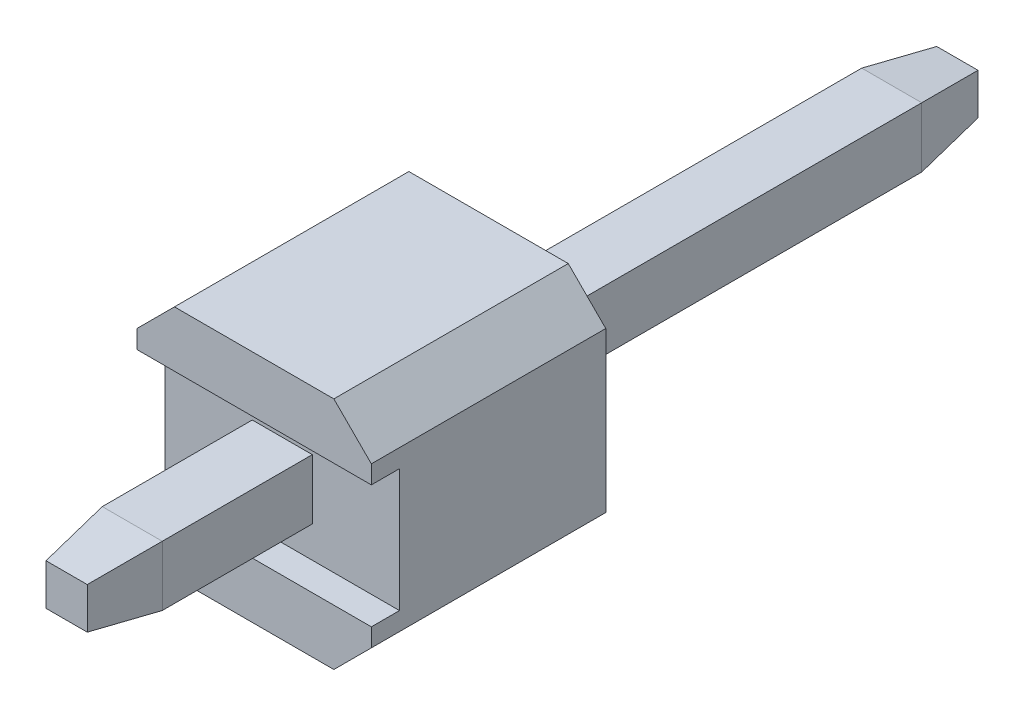
ISO-10303-21;
HEADER;
FILE_DESCRIPTION(('STEP AP214'),'2;1');
FILE_NAME('part.step','',(''),(''),'','','');
FILE_SCHEMA(('AUTOMOTIVE_DESIGN { 1 0 10303 214 1 1 1 1 }'));
ENDSEC;
DATA;
#1=APPLICATION_CONTEXT('core data for automotive mechanical design processes');
#2=APPLICATION_PROTOCOL_DEFINITION('international standard','automotive_design',2000,#1);
#3=PRODUCT_CONTEXT('',#1,'mechanical');
#4=PRODUCT('Part','Part','',(#3));
#5=PRODUCT_RELATED_PRODUCT_CATEGORY('part','',(#4));
#6=PRODUCT_DEFINITION_FORMATION('','',#4);
#7=PRODUCT_DEFINITION_CONTEXT('part definition',#1,'design');
#8=PRODUCT_DEFINITION('design','',#6,#7);
#9=PRODUCT_DEFINITION_SHAPE('','',#8);
#10=(LENGTH_UNIT() NAMED_UNIT(*) SI_UNIT(.MILLI.,.METRE.));
#11=(NAMED_UNIT(*) PLANE_ANGLE_UNIT() SI_UNIT($,.RADIAN.));
#12=(NAMED_UNIT(*) SI_UNIT($,.STERADIAN.) SOLID_ANGLE_UNIT());
#13=UNCERTAINTY_MEASURE_WITH_UNIT(LENGTH_MEASURE(1.E-05),#10,'distance_accuracy_value','');
#14=(GEOMETRIC_REPRESENTATION_CONTEXT(3) GLOBAL_UNCERTAINTY_ASSIGNED_CONTEXT((#13)) GLOBAL_UNIT_ASSIGNED_CONTEXT((#10,
#11,#12)) REPRESENTATION_CONTEXT('',''));
#15=CARTESIAN_POINT('',(0.,0.,0.));
#16=DIRECTION('',(0.,0.,1.));
#17=DIRECTION('',(1.,0.,0.));
#18=AXIS2_PLACEMENT_3D('',#15,#16,#17);
#19=CARTESIAN_POINT('',(-0.16,-0.27,-4.65));
#20=DIRECTION('',(0.,-0.989949493661167,-0.14142135623731));
#21=DIRECTION('',(0.,0.14142135623731,-0.989949493661167));
#22=AXIS2_PLACEMENT_3D('',#19,#20,#21);
#23=PLANE('',#22);
#24=DIRECTION('',(1.,0.,0.));
#25=VECTOR('',#24,1.);
#26=CARTESIAN_POINT('',(-0.16,-0.22,-5.));
#27=LINE('',#26,#25);
#28=CARTESIAN_POINT('',(-0.22,-0.22,-5.));
#29=VERTEX_POINT('',#28);
#30=CARTESIAN_POINT('',(0.22,-0.22,-5.));
#31=VERTEX_POINT('',#30);
#32=EDGE_CURVE('P0_E11',#29,#31,#27,.T.);
#33=ORIENTED_EDGE('',*,*,#32,.T.);
#34=DIRECTION('',(0.140028008402801,-0.140028008402801,0.980196058819607));
#35=VECTOR('',#34,1.);
#36=CARTESIAN_POINT('',(0.22,-0.22,-5.));
#37=LINE('',#36,#35);
#38=CARTESIAN_POINT('',(0.32,-0.32,-4.3));
#39=VERTEX_POINT('',#38);
#40=EDGE_CURVE('P0_E28',#31,#39,#37,.T.);
#41=ORIENTED_EDGE('',*,*,#40,.T.);
#42=DIRECTION('',(-1.,0.,0.));
#43=VECTOR('',#42,1.);
#44=CARTESIAN_POINT('',(-0.16,-0.32,-4.3));
#45=LINE('',#44,#43);
#46=CARTESIAN_POINT('',(-0.32,-0.32,-4.3));
#47=VERTEX_POINT('',#46);
#48=EDGE_CURVE('P0_E129',#39,#47,#45,.T.);
#49=ORIENTED_EDGE('',*,*,#48,.T.);
#50=DIRECTION('',(-0.140028008402801,-0.140028008402801,0.980196058819607));
#51=VECTOR('',#50,1.);
#52=CARTESIAN_POINT('',(-0.22,-0.22,-5.));
#53=LINE('',#52,#51);
#54=EDGE_CURVE('P0_E124',#29,#47,#53,.T.);
#55=ORIENTED_EDGE('',*,*,#54,.F.);
#56=EDGE_LOOP('',(#33,#41,#49,#55));
#57=FACE_BOUND('',#56,.T.);
#58=ADVANCED_FACE('P0_F17',(#57),#23,.T.);
#59=CARTESIAN_POINT('',(0.27,-0.16,-4.65));
#60=DIRECTION('',(0.989949493661167,0.,-0.14142135623731));
#61=DIRECTION('',(0.,-1.,0.));
#62=AXIS2_PLACEMENT_3D('',#59,#60,#61);
#63=PLANE('',#62);
#64=DIRECTION('',(0.,1.,0.));
#65=VECTOR('',#64,1.);
#66=CARTESIAN_POINT('',(0.22,-0.16,-5.));
#67=LINE('',#66,#65);
#68=CARTESIAN_POINT('',(0.22,0.22,-5.));
#69=VERTEX_POINT('',#68);
#70=EDGE_CURVE('P0_E132',#31,#69,#67,.T.);
#71=ORIENTED_EDGE('',*,*,#70,.T.);
#72=DIRECTION('',(0.140028008402801,0.140028008402801,0.980196058819607));
#73=VECTOR('',#72,1.);
#74=CARTESIAN_POINT('',(0.22,0.22,-5.));
#75=LINE('',#74,#73);
#76=CARTESIAN_POINT('',(0.32,0.32,-4.3));
#77=VERTEX_POINT('',#76);
#78=EDGE_CURVE('P0_E138',#69,#77,#75,.T.);
#79=ORIENTED_EDGE('',*,*,#78,.T.);
#80=DIRECTION('',(0.,-1.,0.));
#81=VECTOR('',#80,1.);
#82=CARTESIAN_POINT('',(0.32,-0.16,-4.3));
#83=LINE('',#82,#81);
#84=EDGE_CURVE('P0_E146',#77,#39,#83,.T.);
#85=ORIENTED_EDGE('',*,*,#84,.T.);
#86=ORIENTED_EDGE('',*,*,#40,.F.);
#87=EDGE_LOOP('',(#71,#79,#85,#86));
#88=FACE_BOUND('',#87,.T.);
#89=ADVANCED_FACE('P0_F182',(#88),#63,.T.);
#90=CARTESIAN_POINT('',(0.16,0.27,-4.65));
#91=DIRECTION('',(0.,0.989949493661167,-0.14142135623731));
#92=DIRECTION('',(-1.,0.,0.));
#93=AXIS2_PLACEMENT_3D('',#90,#91,#92);
#94=PLANE('',#93);
#95=DIRECTION('',(-1.,0.,0.));
#96=VECTOR('',#95,1.);
#97=CARTESIAN_POINT('',(0.16,0.22,-5.));
#98=LINE('',#97,#96);
#99=CARTESIAN_POINT('',(-0.22,0.22,-5.));
#100=VERTEX_POINT('',#99);
#101=EDGE_CURVE('P0_E150',#69,#100,#98,.T.);
#102=ORIENTED_EDGE('',*,*,#101,.T.);
#103=DIRECTION('',(-0.140028008402801,0.140028008402801,0.980196058819607));
#104=VECTOR('',#103,1.);
#105=CARTESIAN_POINT('',(-0.22,0.22,-5.));
#106=LINE('',#105,#104);
#107=CARTESIAN_POINT('',(-0.32,0.32,-4.3));
#108=VERTEX_POINT('',#107);
#109=EDGE_CURVE('P0_E153',#100,#108,#106,.T.);
#110=ORIENTED_EDGE('',*,*,#109,.T.);
#111=DIRECTION('',(1.,0.,0.));
#112=VECTOR('',#111,1.);
#113=CARTESIAN_POINT('',(0.16,0.32,-4.3));
#114=LINE('',#113,#112);
#115=EDGE_CURVE('P0_E103',#108,#77,#114,.T.);
#116=ORIENTED_EDGE('',*,*,#115,.T.);
#117=ORIENTED_EDGE('',*,*,#78,.F.);
#118=EDGE_LOOP('',(#102,#110,#116,#117));
#119=FACE_BOUND('',#118,.T.);
#120=ADVANCED_FACE('P0_F19',(#119),#94,.T.);
#121=CARTESIAN_POINT('',(-0.27,0.16,-4.65));
#122=DIRECTION('',(-0.989949493661167,0.,-0.14142135623731));
#123=DIRECTION('',(-0.14142135623731,0.,0.989949493661167));
#124=AXIS2_PLACEMENT_3D('',#121,#122,#123);
#125=PLANE('',#124);
#126=DIRECTION('',(0.,1.,0.));
#127=VECTOR('',#126,1.);
#128=CARTESIAN_POINT('',(-0.32,0.16,-4.3));
#129=LINE('',#128,#127);
#130=EDGE_CURVE('P0_E122',#47,#108,#129,.T.);
#131=ORIENTED_EDGE('',*,*,#130,.T.);
#132=ORIENTED_EDGE('',*,*,#109,.F.);
#133=DIRECTION('',(0.,-1.,0.));
#134=VECTOR('',#133,1.);
#135=CARTESIAN_POINT('',(-0.22,0.16,-5.));
#136=LINE('',#135,#134);
#137=EDGE_CURVE('P0_E127',#100,#29,#136,.T.);
#138=ORIENTED_EDGE('',*,*,#137,.T.);
#139=ORIENTED_EDGE('',*,*,#54,.T.);
#140=EDGE_LOOP('',(#131,#132,#138,#139));
#141=FACE_BOUND('',#140,.T.);
#142=ADVANCED_FACE('P0_F184',(#141),#125,.T.);
#143=CARTESIAN_POINT('',(-0.32,0.32,0.));
#144=DIRECTION('',(-1.,0.,0.));
#145=DIRECTION('',(0.,0.,1.));
#146=AXIS2_PLACEMENT_3D('',#143,#144,#145);
#147=PLANE('',#146);
#148=ORIENTED_EDGE('',*,*,#130,.F.);
#149=DIRECTION('',(0.,0.,1.));
#150=VECTOR('',#149,1.);
#151=CARTESIAN_POINT('',(-0.32,-0.32,0.));
#152=LINE('',#151,#150);
#153=CARTESIAN_POINT('',(-0.32,-0.32,2.));
#154=VERTEX_POINT('',#153);
#155=EDGE_CURVE('P0_E21',#47,#154,#152,.T.);
#156=ORIENTED_EDGE('',*,*,#155,.T.);
#157=DIRECTION('',(0.,-1.,0.));
#158=VECTOR('',#157,1.);
#159=CARTESIAN_POINT('',(-0.32,0.16,2.));
#160=LINE('',#159,#158);
#161=CARTESIAN_POINT('',(-0.32,0.32,2.));
#162=VERTEX_POINT('',#161);
#163=EDGE_CURVE('P0_E82',#162,#154,#160,.T.);
#164=ORIENTED_EDGE('',*,*,#163,.F.);
#165=DIRECTION('',(0.,0.,1.));
#166=VECTOR('',#165,1.);
#167=CARTESIAN_POINT('',(-0.32,0.32,0.));
#168=LINE('',#167,#166);
#169=EDGE_CURVE('P0_E91',#108,#162,#168,.T.);
#170=ORIENTED_EDGE('',*,*,#169,.F.);
#171=EDGE_LOOP('',(#148,#156,#164,#170));
#172=FACE_BOUND('',#171,.T.);
#173=ADVANCED_FACE('P0_F90',(#172),#147,.T.);
#174=CARTESIAN_POINT('',(-0.32,-0.32,0.));
#175=DIRECTION('',(0.,-1.,0.));
#176=DIRECTION('',(0.,0.,-1.));
#177=AXIS2_PLACEMENT_3D('',#174,#175,#176);
#178=PLANE('',#177);
#179=ORIENTED_EDGE('',*,*,#48,.F.);
#180=DIRECTION('',(0.,0.,1.));
#181=VECTOR('',#180,1.);
#182=CARTESIAN_POINT('',(0.32,-0.32,0.));
#183=LINE('',#182,#181);
#184=CARTESIAN_POINT('',(0.32,-0.32,2.));
#185=VERTEX_POINT('',#184);
#186=EDGE_CURVE('P0_E106',#39,#185,#183,.T.);
#187=ORIENTED_EDGE('',*,*,#186,.T.);
#188=DIRECTION('',(1.,0.,0.));
#189=VECTOR('',#188,1.);
#190=CARTESIAN_POINT('',(-0.16,-0.32,2.));
#191=LINE('',#190,#189);
#192=EDGE_CURVE('P0_E96',#154,#185,#191,.T.);
#193=ORIENTED_EDGE('',*,*,#192,.F.);
#194=ORIENTED_EDGE('',*,*,#155,.F.);
#195=EDGE_LOOP('',(#179,#187,#193,#194));
#196=FACE_BOUND('',#195,.T.);
#197=ADVANCED_FACE('P0_F178',(#196),#178,.T.);
#198=CARTESIAN_POINT('',(0.,0.,-5.));
#199=DIRECTION('',(0.,0.,-1.));
#200=DIRECTION('',(0.,-1.,0.));
#201=AXIS2_PLACEMENT_3D('',#198,#199,#200);
#202=PLANE('',#201);
#203=ORIENTED_EDGE('',*,*,#32,.F.);
#204=ORIENTED_EDGE('',*,*,#137,.F.);
#205=ORIENTED_EDGE('',*,*,#101,.F.);
#206=ORIENTED_EDGE('',*,*,#70,.F.);
#207=EDGE_LOOP('',(#203,#204,#205,#206));
#208=FACE_BOUND('',#207,.T.);
#209=ADVANCED_FACE('P0_F198',(#208),#202,.T.);
#210=CARTESIAN_POINT('',(0.32,-0.32,0.));
#211=DIRECTION('',(1.,0.,0.));
#212=DIRECTION('',(0.,1.,0.));
#213=AXIS2_PLACEMENT_3D('',#210,#211,#212);
#214=PLANE('',#213);
#215=ORIENTED_EDGE('',*,*,#84,.F.);
#216=DIRECTION('',(0.,0.,-1.));
#217=VECTOR('',#216,1.);
#218=CARTESIAN_POINT('',(0.32,0.32,0.));
#219=LINE('',#218,#217);
#220=CARTESIAN_POINT('',(0.32,0.32,2.));
#221=VERTEX_POINT('',#220);
#222=EDGE_CURVE('P0_E107',#221,#77,#219,.T.);
#223=ORIENTED_EDGE('',*,*,#222,.F.);
#224=DIRECTION('',(0.,1.,0.));
#225=VECTOR('',#224,1.);
#226=CARTESIAN_POINT('',(0.32,-0.16,2.));
#227=LINE('',#226,#225);
#228=EDGE_CURVE('P0_E111',#185,#221,#227,.T.);
#229=ORIENTED_EDGE('',*,*,#228,.F.);
#230=ORIENTED_EDGE('',*,*,#186,.F.);
#231=EDGE_LOOP('',(#215,#223,#229,#230));
#232=FACE_BOUND('',#231,.T.);
#233=ADVANCED_FACE('P0_F181',(#232),#214,.T.);
#234=CARTESIAN_POINT('',(0.32,0.32,0.));
#235=DIRECTION('',(0.,1.,0.));
#236=DIRECTION('',(1.,0.,0.));
#237=AXIS2_PLACEMENT_3D('',#234,#235,#236);
#238=PLANE('',#237);
#239=ORIENTED_EDGE('',*,*,#115,.F.);
#240=ORIENTED_EDGE('',*,*,#169,.T.);
#241=DIRECTION('',(-1.,0.,0.));
#242=VECTOR('',#241,1.);
#243=CARTESIAN_POINT('',(0.16,0.32,2.));
#244=LINE('',#243,#242);
#245=EDGE_CURVE('P0_E95',#221,#162,#244,.T.);
#246=ORIENTED_EDGE('',*,*,#245,.F.);
#247=ORIENTED_EDGE('',*,*,#222,.T.);
#248=EDGE_LOOP('',(#239,#240,#246,#247));
#249=FACE_BOUND('',#248,.T.);
#250=ADVANCED_FACE('P0_F101',(#249),#238,.T.);
#251=CARTESIAN_POINT('',(0.,0.,2.));
#252=DIRECTION('',(0.,0.,1.));
#253=DIRECTION('',(1.,0.,0.));
#254=AXIS2_PLACEMENT_3D('',#251,#252,#253);
#255=PLANE('',#254);
#256=ORIENTED_EDGE('',*,*,#245,.T.);
#257=ORIENTED_EDGE('',*,*,#163,.T.);
#258=ORIENTED_EDGE('',*,*,#192,.T.);
#259=ORIENTED_EDGE('',*,*,#228,.T.);
#260=EDGE_LOOP('',(#256,#257,#258,#259));
#261=FACE_BOUND('',#260,.T.);
#262=ADVANCED_FACE('P0_F109',(#261),#255,.T.);
#263=CLOSED_SHELL('',(#58,#89,#120,#142,#173,#197,#209,#233,#250,#262));
#264=MANIFOLD_SOLID_BREP('P0_B1',#263);
#265=CARTESIAN_POINT('',(-1.25,0.655430015301126,2.5));
#266=DIRECTION('',(0.,1.,0.));
#267=DIRECTION('',(1.,0.,0.));
#268=AXIS2_PLACEMENT_3D('',#265,#266,#267);
#269=PLANE('',#268);
#270=DIRECTION('',(1.,0.,0.));
#271=VECTOR('',#270,1.);
#272=CARTESIAN_POINT('',(-0.625,0.655430015301126,2.5));
#273=LINE('',#272,#271);
#274=CARTESIAN_POINT('',(-1.25,0.655430015301126,2.5));
#275=VERTEX_POINT('',#274);
#276=CARTESIAN_POINT('',(1.25,0.655430015301126,2.5));
#277=VERTEX_POINT('',#276);
#278=EDGE_CURVE('P1_E218',#275,#277,#273,.T.);
#279=ORIENTED_EDGE('',*,*,#278,.F.);
#280=DIRECTION('',(0.,0.,1.));
#281=VECTOR('',#280,1.);
#282=CARTESIAN_POINT('',(-1.25,0.655430015301126,1.25));
#283=LINE('',#282,#281);
#284=CARTESIAN_POINT('',(-1.25,0.655430015301126,2.2));
#285=VERTEX_POINT('',#284);
#286=EDGE_CURVE('P1_E42',#285,#275,#283,.T.);
#287=ORIENTED_EDGE('',*,*,#286,.F.);
#288=DIRECTION('',(1.,0.,0.));
#289=VECTOR('',#288,1.);
#290=CARTESIAN_POINT('',(-1.25,0.655430015301126,2.2));
#291=LINE('',#290,#289);
#292=CARTESIAN_POINT('',(1.25,0.655430015301126,2.2));
#293=VERTEX_POINT('',#292);
#294=EDGE_CURVE('P1_E11',#285,#293,#291,.T.);
#295=ORIENTED_EDGE('',*,*,#294,.T.);
#296=DIRECTION('',(0.,0.,-1.));
#297=VECTOR('',#296,1.);
#298=CARTESIAN_POINT('',(1.25,0.655430015301126,1.25));
#299=LINE('',#298,#297);
#300=EDGE_CURVE('P1_E230',#277,#293,#299,.T.);
#301=ORIENTED_EDGE('',*,*,#300,.F.);
#302=EDGE_LOOP('',(#279,#287,#295,#301));
#303=FACE_BOUND('',#302,.T.);
#304=ADVANCED_FACE('P1_F17',(#303),#269,.F.);
#305=CARTESIAN_POINT('',(1.25,-0.655430015301126,2.5));
#306=DIRECTION('',(0.,-1.,0.));
#307=DIRECTION('',(0.,0.,-1.));
#308=AXIS2_PLACEMENT_3D('',#305,#306,#307);
#309=PLANE('',#308);
#310=DIRECTION('',(-1.,0.,0.));
#311=VECTOR('',#310,1.);
#312=CARTESIAN_POINT('',(0.625,-0.655430015301126,2.5));
#313=LINE('',#312,#311);
#314=CARTESIAN_POINT('',(1.25,-0.655430015301126,2.5));
#315=VERTEX_POINT('',#314);
#316=CARTESIAN_POINT('',(-1.25,-0.655430015301126,2.5));
#317=VERTEX_POINT('',#316);
#318=EDGE_CURVE('P1_E161',#315,#317,#313,.T.);
#319=ORIENTED_EDGE('',*,*,#318,.F.);
#320=DIRECTION('',(0.,0.,1.));
#321=VECTOR('',#320,1.);
#322=CARTESIAN_POINT('',(1.25,-0.655430015301126,1.25));
#323=LINE('',#322,#321);
#324=CARTESIAN_POINT('',(1.25,-0.655430015301126,2.2));
#325=VERTEX_POINT('',#324);
#326=EDGE_CURVE('P1_E237',#325,#315,#323,.T.);
#327=ORIENTED_EDGE('',*,*,#326,.F.);
#328=DIRECTION('',(-1.,0.,0.));
#329=VECTOR('',#328,1.);
#330=CARTESIAN_POINT('',(1.25,-0.655430015301126,2.2));
#331=LINE('',#330,#329);
#332=CARTESIAN_POINT('',(-1.25,-0.655430015301126,2.2));
#333=VERTEX_POINT('',#332);
#334=EDGE_CURVE('P1_E28',#325,#333,#331,.T.);
#335=ORIENTED_EDGE('',*,*,#334,.T.);
#336=DIRECTION('',(0.,0.,-1.));
#337=VECTOR('',#336,1.);
#338=CARTESIAN_POINT('',(-1.25,-0.655430015301126,1.25));
#339=LINE('',#338,#337);
#340=EDGE_CURVE('P1_E158',#317,#333,#339,.T.);
#341=ORIENTED_EDGE('',*,*,#340,.F.);
#342=EDGE_LOOP('',(#319,#327,#335,#341));
#343=FACE_BOUND('',#342,.T.);
#344=ADVANCED_FACE('P1_F160',(#343),#309,.F.);
#345=CARTESIAN_POINT('',(0.,0.,2.2));
#346=DIRECTION('',(0.,0.,-1.));
#347=DIRECTION('',(0.,-1.,0.));
#348=AXIS2_PLACEMENT_3D('',#345,#346,#347);
#349=PLANE('',#348);
#350=DIRECTION('',(0.,-1.,0.));
#351=VECTOR('',#350,1.);
#352=CARTESIAN_POINT('',(1.25,-0.625,2.2));
#353=LINE('',#352,#351);
#354=EDGE_CURVE('P1_E241',#293,#325,#353,.T.);
#355=ORIENTED_EDGE('',*,*,#354,.F.);
#356=ORIENTED_EDGE('',*,*,#294,.F.);
#357=DIRECTION('',(0.,1.,0.));
#358=VECTOR('',#357,1.);
#359=CARTESIAN_POINT('',(-1.25,0.625,2.2));
#360=LINE('',#359,#358);
#361=EDGE_CURVE('P1_E167',#333,#285,#360,.T.);
#362=ORIENTED_EDGE('',*,*,#361,.F.);
#363=ORIENTED_EDGE('',*,*,#334,.F.);
#364=EDGE_LOOP('',(#355,#356,#362,#363));
#365=FACE_BOUND('',#364,.T.);
#366=DIRECTION('',(0.,-1.,0.));
#367=VECTOR('',#366,1.);
#368=CARTESIAN_POINT('',(-0.32,-0.16,2.2));
#369=LINE('',#368,#367);
#370=CARTESIAN_POINT('',(-0.32,0.32,2.2));
#371=VERTEX_POINT('',#370);
#372=CARTESIAN_POINT('',(-0.32,-0.32,2.2));
#373=VERTEX_POINT('',#372);
#374=EDGE_CURVE('P1_E256',#371,#373,#369,.T.);
#375=ORIENTED_EDGE('',*,*,#374,.F.);
#376=DIRECTION('',(-1.,0.,0.));
#377=VECTOR('',#376,1.);
#378=CARTESIAN_POINT('',(-0.16,0.32,2.2));
#379=LINE('',#378,#377);
#380=CARTESIAN_POINT('',(0.32,0.32,2.2));
#381=VERTEX_POINT('',#380);
#382=EDGE_CURVE('P1_E247',#381,#371,#379,.T.);
#383=ORIENTED_EDGE('',*,*,#382,.F.);
#384=DIRECTION('',(0.,1.,0.));
#385=VECTOR('',#384,1.);
#386=CARTESIAN_POINT('',(0.32,0.16,2.2));
#387=LINE('',#386,#385);
#388=CARTESIAN_POINT('',(0.32,-0.32,2.2));
#389=VERTEX_POINT('',#388);
#390=EDGE_CURVE('P1_E242',#389,#381,#387,.T.);
#391=ORIENTED_EDGE('',*,*,#390,.F.);
#392=DIRECTION('',(1.,0.,0.));
#393=VECTOR('',#392,1.);
#394=CARTESIAN_POINT('',(0.16,-0.32,2.2));
#395=LINE('',#394,#393);
#396=EDGE_CURVE('P1_E275',#373,#389,#395,.T.);
#397=ORIENTED_EDGE('',*,*,#396,.F.);
#398=EDGE_LOOP('',(#375,#383,#391,#397));
#399=FACE_BOUND('',#398,.T.);
#400=ADVANCED_FACE('P1_F430',(#365,#399),#349,.F.);
#401=CARTESIAN_POINT('',(0.,0.,2.5));
#402=DIRECTION('',(0.,0.,1.));
#403=DIRECTION('',(1.,0.,0.));
#404=AXIS2_PLACEMENT_3D('',#401,#402,#403);
#405=PLANE('',#404);
#406=ORIENTED_EDGE('',*,*,#318,.T.);
#407=DIRECTION('',(0.,-1.,0.));
#408=VECTOR('',#407,1.);
#409=CARTESIAN_POINT('',(-1.25,-1.25,2.5));
#410=LINE('',#409,#408);
#411=CARTESIAN_POINT('',(-1.25,-0.85,2.5));
#412=VERTEX_POINT('',#411);
#413=EDGE_CURVE('P1_E172',#317,#412,#410,.T.);
#414=ORIENTED_EDGE('',*,*,#413,.T.);
#415=DIRECTION('',(-0.707106781186548,0.707106781186548,0.));
#416=VECTOR('',#415,1.);
#417=CARTESIAN_POINT('',(-1.05,-1.05,2.5));
#418=LINE('',#417,#416);
#419=CARTESIAN_POINT('',(-0.85,-1.25,2.5));
#420=VERTEX_POINT('',#419);
#421=EDGE_CURVE('P1_E208',#420,#412,#418,.T.);
#422=ORIENTED_EDGE('',*,*,#421,.F.);
#423=DIRECTION('',(1.,0.,0.));
#424=VECTOR('',#423,1.);
#425=CARTESIAN_POINT('',(1.25,-1.25,2.5));
#426=LINE('',#425,#424);
#427=CARTESIAN_POINT('',(0.85,-1.25,2.5));
#428=VERTEX_POINT('',#427);
#429=EDGE_CURVE('P1_E184',#420,#428,#426,.T.);
#430=ORIENTED_EDGE('',*,*,#429,.T.);
#431=DIRECTION('',(-0.707106781186548,-0.707106781186548,0.));
#432=VECTOR('',#431,1.);
#433=CARTESIAN_POINT('',(1.05,-1.05,2.5));
#434=LINE('',#433,#432);
#435=CARTESIAN_POINT('',(1.25,-0.85,2.5));
#436=VERTEX_POINT('',#435);
#437=EDGE_CURVE('P1_E205',#436,#428,#434,.T.);
#438=ORIENTED_EDGE('',*,*,#437,.F.);
#439=DIRECTION('',(0.,1.,0.));
#440=VECTOR('',#439,1.);
#441=CARTESIAN_POINT('',(1.25,1.25,2.5));
#442=LINE('',#441,#440);
#443=EDGE_CURVE('P1_E176',#436,#315,#442,.T.);
#444=ORIENTED_EDGE('',*,*,#443,.T.);
#445=EDGE_LOOP('',(#406,#414,#422,#430,#438,#444));
#446=FACE_BOUND('',#445,.T.);
#447=ADVANCED_FACE('P1_F171',(#446),#405,.T.);
#448=CARTESIAN_POINT('',(0.,0.,2.5));
#449=DIRECTION('',(0.,0.,1.));
#450=DIRECTION('',(1.,0.,0.));
#451=AXIS2_PLACEMENT_3D('',#448,#449,#450);
#452=PLANE('',#451);
#453=ORIENTED_EDGE('',*,*,#278,.T.);
#454=DIRECTION('',(0.,1.,0.));
#455=VECTOR('',#454,1.);
#456=CARTESIAN_POINT('',(1.25,1.25,2.5));
#457=LINE('',#456,#455);
#458=CARTESIAN_POINT('',(1.25,0.85,2.5));
#459=VERTEX_POINT('',#458);
#460=EDGE_CURVE('P1_E214',#277,#459,#457,.T.);
#461=ORIENTED_EDGE('',*,*,#460,.T.);
#462=DIRECTION('',(0.707106781186548,-0.707106781186548,0.));
#463=VECTOR('',#462,1.);
#464=CARTESIAN_POINT('',(1.05,1.05,2.5));
#465=LINE('',#464,#463);
#466=CARTESIAN_POINT('',(0.85,1.25,2.5));
#467=VERTEX_POINT('',#466);
#468=EDGE_CURVE('P1_E265',#467,#459,#465,.T.);
#469=ORIENTED_EDGE('',*,*,#468,.F.);
#470=DIRECTION('',(-1.,0.,0.));
#471=VECTOR('',#470,1.);
#472=CARTESIAN_POINT('',(-1.25,1.25,2.5));
#473=LINE('',#472,#471);
#474=CARTESIAN_POINT('',(-0.85,1.25,2.5));
#475=VERTEX_POINT('',#474);
#476=EDGE_CURVE('P1_E219',#467,#475,#473,.T.);
#477=ORIENTED_EDGE('',*,*,#476,.T.);
#478=DIRECTION('',(0.707106781186548,0.707106781186548,0.));
#479=VECTOR('',#478,1.);
#480=CARTESIAN_POINT('',(-1.05,1.05,2.5));
#481=LINE('',#480,#479);
#482=CARTESIAN_POINT('',(-1.25,0.85,2.5));
#483=VERTEX_POINT('',#482);
#484=EDGE_CURVE('P1_E200',#483,#475,#481,.T.);
#485=ORIENTED_EDGE('',*,*,#484,.F.);
#486=DIRECTION('',(0.,-1.,0.));
#487=VECTOR('',#486,1.);
#488=CARTESIAN_POINT('',(-1.25,-1.25,2.5));
#489=LINE('',#488,#487);
#490=EDGE_CURVE('P1_E226',#483,#275,#489,.T.);
#491=ORIENTED_EDGE('',*,*,#490,.T.);
#492=EDGE_LOOP('',(#453,#461,#469,#477,#485,#491));
#493=FACE_BOUND('',#492,.T.);
#494=ADVANCED_FACE('P1_F429',(#493),#452,.T.);
#495=CARTESIAN_POINT('',(1.25,-1.25,0.));
#496=DIRECTION('',(1.,0.,0.));
#497=DIRECTION('',(0.,1.,0.));
#498=AXIS2_PLACEMENT_3D('',#495,#496,#497);
#499=PLANE('',#498);
#500=ORIENTED_EDGE('',*,*,#300,.T.);
#501=ORIENTED_EDGE('',*,*,#354,.T.);
#502=ORIENTED_EDGE('',*,*,#326,.T.);
#503=ORIENTED_EDGE('',*,*,#443,.F.);
#504=DIRECTION('',(0.,0.,1.));
#505=VECTOR('',#504,1.);
#506=CARTESIAN_POINT('',(1.25,-0.85,0.));
#507=LINE('',#506,#505);
#508=CARTESIAN_POINT('',(1.25,-0.85,0.));
#509=VERTEX_POINT('',#508);
#510=EDGE_CURVE('P1_E500',#509,#436,#507,.T.);
#511=ORIENTED_EDGE('',*,*,#510,.F.);
#512=DIRECTION('',(0.,-1.,0.));
#513=VECTOR('',#512,1.);
#514=CARTESIAN_POINT('',(1.25,1.25,0.));
#515=LINE('',#514,#513);
#516=CARTESIAN_POINT('',(1.25,0.85,0.));
#517=VERTEX_POINT('',#516);
#518=EDGE_CURVE('P1_E252',#517,#509,#515,.T.);
#519=ORIENTED_EDGE('',*,*,#518,.F.);
#520=DIRECTION('',(0.,0.,-1.));
#521=VECTOR('',#520,1.);
#522=CARTESIAN_POINT('',(1.25,0.85,0.));
#523=LINE('',#522,#521);
#524=EDGE_CURVE('P1_E194',#459,#517,#523,.T.);
#525=ORIENTED_EDGE('',*,*,#524,.F.);
#526=ORIENTED_EDGE('',*,*,#460,.F.);
#527=EDGE_LOOP('',(#500,#501,#502,#503,#511,#519,#525,#526));
#528=FACE_BOUND('',#527,.T.);
#529=ADVANCED_FACE('P1_F459',(#528),#499,.T.);
#530=CARTESIAN_POINT('',(0.32,0.32,0.));
#531=DIRECTION('',(-1.,0.,0.));
#532=DIRECTION('',(0.,0.,1.));
#533=AXIS2_PLACEMENT_3D('',#530,#531,#532);
#534=PLANE('',#533);
#535=ORIENTED_EDGE('',*,*,#390,.T.);
#536=DIRECTION('',(0.,0.,1.));
#537=VECTOR('',#536,1.);
#538=CARTESIAN_POINT('',(0.32,0.32,0.));
#539=LINE('',#538,#537);
#540=CARTESIAN_POINT('',(0.32,0.32,0.));
#541=VERTEX_POINT('',#540);
#542=EDGE_CURVE('P1_E213',#541,#381,#539,.T.);
#543=ORIENTED_EDGE('',*,*,#542,.F.);
#544=DIRECTION('',(0.,-1.,0.));
#545=VECTOR('',#544,1.);
#546=CARTESIAN_POINT('',(0.32,0.32,0.));
#547=LINE('',#546,#545);
#548=CARTESIAN_POINT('',(0.32,-0.32,0.));
#549=VERTEX_POINT('',#548);
#550=EDGE_CURVE('P1_E21',#541,#549,#547,.T.);
#551=ORIENTED_EDGE('',*,*,#550,.T.);
#552=DIRECTION('',(0.,0.,1.));
#553=VECTOR('',#552,1.);
#554=CARTESIAN_POINT('',(0.32,-0.32,0.));
#555=LINE('',#554,#553);
#556=EDGE_CURVE('P1_E334',#549,#389,#555,.T.);
#557=ORIENTED_EDGE('',*,*,#556,.T.);
#558=EDGE_LOOP('',(#535,#543,#551,#557));
#559=FACE_BOUND('',#558,.T.);
#560=ADVANCED_FACE('P1_F19',(#559),#534,.T.);
#561=CARTESIAN_POINT('',(-0.32,0.32,0.));
#562=DIRECTION('',(0.,-1.,0.));
#563=DIRECTION('',(0.,0.,-1.));
#564=AXIS2_PLACEMENT_3D('',#561,#562,#563);
#565=PLANE('',#564);
#566=ORIENTED_EDGE('',*,*,#382,.T.);
#567=DIRECTION('',(0.,0.,1.));
#568=VECTOR('',#567,1.);
#569=CARTESIAN_POINT('',(-0.32,0.32,0.));
#570=LINE('',#569,#568);
#571=CARTESIAN_POINT('',(-0.32,0.32,0.));
#572=VERTEX_POINT('',#571);
#573=EDGE_CURVE('P1_E257',#572,#371,#570,.T.);
#574=ORIENTED_EDGE('',*,*,#573,.F.);
#575=DIRECTION('',(1.,0.,0.));
#576=VECTOR('',#575,1.);
#577=CARTESIAN_POINT('',(-0.32,0.32,0.));
#578=LINE('',#577,#576);
#579=EDGE_CURVE('P1_E243',#572,#541,#578,.T.);
#580=ORIENTED_EDGE('',*,*,#579,.T.);
#581=ORIENTED_EDGE('',*,*,#542,.T.);
#582=EDGE_LOOP('',(#566,#574,#580,#581));
#583=FACE_BOUND('',#582,.T.);
#584=ADVANCED_FACE('P1_F445',(#583),#565,.T.);
#585=CARTESIAN_POINT('',(-1.05,-1.05,0.));
#586=DIRECTION('',(-0.707106781186548,-0.707106781186548,0.));
#587=DIRECTION('',(-0.707106781186548,0.707106781186548,0.));
#588=AXIS2_PLACEMENT_3D('',#585,#586,#587);
#589=PLANE('',#588);
#590=ORIENTED_EDGE('',*,*,#421,.T.);
#591=DIRECTION('',(0.,0.,-1.));
#592=VECTOR('',#591,1.);
#593=CARTESIAN_POINT('',(-1.25,-0.85,0.));
#594=LINE('',#593,#592);
#595=CARTESIAN_POINT('',(-1.25,-0.85,0.));
#596=VERTEX_POINT('',#595);
#597=EDGE_CURVE('P1_E182',#412,#596,#594,.T.);
#598=ORIENTED_EDGE('',*,*,#597,.T.);
#599=DIRECTION('',(0.707106781186548,-0.707106781186548,0.));
#600=VECTOR('',#599,1.);
#601=CARTESIAN_POINT('',(-1.05,-1.05,0.));
#602=LINE('',#601,#600);
#603=CARTESIAN_POINT('',(-0.85,-1.25,0.));
#604=VERTEX_POINT('',#603);
#605=EDGE_CURVE('P1_E209',#596,#604,#602,.T.);
#606=ORIENTED_EDGE('',*,*,#605,.T.);
#607=DIRECTION('',(0.,0.,1.));
#608=VECTOR('',#607,1.);
#609=CARTESIAN_POINT('',(-0.85,-1.25,0.));
#610=LINE('',#609,#608);
#611=EDGE_CURVE('P1_E223',#604,#420,#610,.T.);
#612=ORIENTED_EDGE('',*,*,#611,.T.);
#613=EDGE_LOOP('',(#590,#598,#606,#612));
#614=FACE_BOUND('',#613,.T.);
#615=ADVANCED_FACE('P1_F376',(#614),#589,.T.);
#616=CARTESIAN_POINT('',(-1.25,-1.25,0.));
#617=DIRECTION('',(0.,-1.,0.));
#618=DIRECTION('',(0.,0.,-1.));
#619=AXIS2_PLACEMENT_3D('',#616,#617,#618);
#620=PLANE('',#619);
#621=ORIENTED_EDGE('',*,*,#611,.F.);
#622=DIRECTION('',(-1.,0.,0.));
#623=VECTOR('',#622,1.);
#624=CARTESIAN_POINT('',(1.25,-1.25,0.));
#625=LINE('',#624,#623);
#626=CARTESIAN_POINT('',(0.85,-1.25,0.));
#627=VERTEX_POINT('',#626);
#628=EDGE_CURVE('P1_E248',#627,#604,#625,.T.);
#629=ORIENTED_EDGE('',*,*,#628,.F.);
#630=DIRECTION('',(0.,0.,-1.));
#631=VECTOR('',#630,1.);
#632=CARTESIAN_POINT('',(0.85,-1.25,0.));
#633=LINE('',#632,#631);
#634=EDGE_CURVE('P1_E202',#428,#627,#633,.T.);
#635=ORIENTED_EDGE('',*,*,#634,.F.);
#636=ORIENTED_EDGE('',*,*,#429,.F.);
#637=EDGE_LOOP('',(#621,#629,#635,#636));
#638=FACE_BOUND('',#637,.T.);
#639=ADVANCED_FACE('P1_F370',(#638),#620,.T.);
#640=CARTESIAN_POINT('',(0.,0.,0.));
#641=DIRECTION('',(0.,0.,1.));
#642=DIRECTION('',(1.,0.,0.));
#643=AXIS2_PLACEMENT_3D('',#640,#641,#642);
#644=PLANE('',#643);
#645=ORIENTED_EDGE('',*,*,#605,.F.);
#646=DIRECTION('',(0.,1.,0.));
#647=VECTOR('',#646,1.);
#648=CARTESIAN_POINT('',(-1.25,-1.25,0.));
#649=LINE('',#648,#647);
#650=CARTESIAN_POINT('',(-1.25,0.85,0.));
#651=VERTEX_POINT('',#650);
#652=EDGE_CURVE('P1_E220',#596,#651,#649,.T.);
#653=ORIENTED_EDGE('',*,*,#652,.T.);
#654=DIRECTION('',(-0.707106781186548,-0.707106781186548,0.));
#655=VECTOR('',#654,1.);
#656=CARTESIAN_POINT('',(-1.05,1.05,0.));
#657=LINE('',#656,#655);
#658=CARTESIAN_POINT('',(-0.85,1.25,0.));
#659=VERTEX_POINT('',#658);
#660=EDGE_CURVE('P1_E201',#659,#651,#657,.T.);
#661=ORIENTED_EDGE('',*,*,#660,.F.);
#662=DIRECTION('',(1.,0.,0.));
#663=VECTOR('',#662,1.);
#664=CARTESIAN_POINT('',(-1.25,1.25,0.));
#665=LINE('',#664,#663);
#666=CARTESIAN_POINT('',(0.85,1.25,0.));
#667=VERTEX_POINT('',#666);
#668=EDGE_CURVE('P1_E224',#659,#667,#665,.T.);
#669=ORIENTED_EDGE('',*,*,#668,.T.);
#670=DIRECTION('',(-0.707106781186548,0.707106781186548,0.));
#671=VECTOR('',#670,1.);
#672=CARTESIAN_POINT('',(1.05,1.05,0.));
#673=LINE('',#672,#671);
#674=EDGE_CURVE('P1_E536',#517,#667,#673,.T.);
#675=ORIENTED_EDGE('',*,*,#674,.F.);
#676=ORIENTED_EDGE('',*,*,#518,.T.);
#677=DIRECTION('',(0.707106781186548,0.707106781186548,0.));
#678=VECTOR('',#677,1.);
#679=CARTESIAN_POINT('',(1.05,-1.05,0.));
#680=LINE('',#679,#678);
#681=EDGE_CURVE('P1_E206',#627,#509,#680,.T.);
#682=ORIENTED_EDGE('',*,*,#681,.F.);
#683=ORIENTED_EDGE('',*,*,#628,.T.);
#684=EDGE_LOOP('',(#645,#653,#661,#669,#675,#676,#682,#683));
#685=FACE_BOUND('',#684,.T.);
#686=ORIENTED_EDGE('',*,*,#579,.F.);
#687=DIRECTION('',(0.,1.,0.));
#688=VECTOR('',#687,1.);
#689=CARTESIAN_POINT('',(-0.32,-0.32,0.));
#690=LINE('',#689,#688);
#691=CARTESIAN_POINT('',(-0.32,-0.32,0.));
#692=VERTEX_POINT('',#691);
#693=EDGE_CURVE('P1_E253',#692,#572,#690,.T.);
#694=ORIENTED_EDGE('',*,*,#693,.F.);
#695=DIRECTION('',(-1.,0.,0.));
#696=VECTOR('',#695,1.);
#697=CARTESIAN_POINT('',(0.32,-0.32,0.));
#698=LINE('',#697,#696);
#699=EDGE_CURVE('P1_E277',#549,#692,#698,.T.);
#700=ORIENTED_EDGE('',*,*,#699,.F.);
#701=ORIENTED_EDGE('',*,*,#550,.F.);
#702=EDGE_LOOP('',(#686,#694,#700,#701));
#703=FACE_BOUND('',#702,.T.);
#704=ADVANCED_FACE('P1_F375',(#685,#703),#644,.F.);
#705=CARTESIAN_POINT('',(-1.05,1.05,0.));
#706=DIRECTION('',(-0.707106781186548,0.707106781186548,0.));
#707=DIRECTION('',(0.,0.,1.));
#708=AXIS2_PLACEMENT_3D('',#705,#706,#707);
#709=PLANE('',#708);
#710=ORIENTED_EDGE('',*,*,#484,.T.);
#711=DIRECTION('',(0.,0.,-1.));
#712=VECTOR('',#711,1.);
#713=CARTESIAN_POINT('',(-0.85,1.25,0.));
#714=LINE('',#713,#712);
#715=EDGE_CURVE('P1_E196',#475,#659,#714,.T.);
#716=ORIENTED_EDGE('',*,*,#715,.T.);
#717=ORIENTED_EDGE('',*,*,#660,.T.);
#718=DIRECTION('',(0.,0.,1.));
#719=VECTOR('',#718,1.);
#720=CARTESIAN_POINT('',(-1.25,0.85,0.));
#721=LINE('',#720,#719);
#722=EDGE_CURVE('P1_E259',#651,#483,#721,.T.);
#723=ORIENTED_EDGE('',*,*,#722,.T.);
#724=EDGE_LOOP('',(#710,#716,#717,#723));
#725=FACE_BOUND('',#724,.T.);
#726=ADVANCED_FACE('P1_F343',(#725),#709,.T.);
#727=CARTESIAN_POINT('',(1.25,1.25,0.));
#728=DIRECTION('',(0.,1.,0.));
#729=DIRECTION('',(1.,0.,0.));
#730=AXIS2_PLACEMENT_3D('',#727,#728,#729);
#731=PLANE('',#730);
#732=ORIENTED_EDGE('',*,*,#715,.F.);
#733=ORIENTED_EDGE('',*,*,#476,.F.);
#734=DIRECTION('',(0.,0.,1.));
#735=VECTOR('',#734,1.);
#736=CARTESIAN_POINT('',(0.85,1.25,0.));
#737=LINE('',#736,#735);
#738=EDGE_CURVE('P1_E497',#667,#467,#737,.T.);
#739=ORIENTED_EDGE('',*,*,#738,.F.);
#740=ORIENTED_EDGE('',*,*,#668,.F.);
#741=EDGE_LOOP('',(#732,#733,#739,#740));
#742=FACE_BOUND('',#741,.T.);
#743=ADVANCED_FACE('P1_F337',(#742),#731,.T.);
#744=CARTESIAN_POINT('',(1.05,1.05,0.));
#745=DIRECTION('',(0.707106781186548,0.707106781186548,0.));
#746=DIRECTION('',(0.,0.,-1.));
#747=AXIS2_PLACEMENT_3D('',#744,#745,#746);
#748=PLANE('',#747);
#749=ORIENTED_EDGE('',*,*,#468,.T.);
#750=ORIENTED_EDGE('',*,*,#524,.T.);
#751=ORIENTED_EDGE('',*,*,#674,.T.);
#752=ORIENTED_EDGE('',*,*,#738,.T.);
#753=EDGE_LOOP('',(#749,#750,#751,#752));
#754=FACE_BOUND('',#753,.T.);
#755=ADVANCED_FACE('P1_F342',(#754),#748,.T.);
#756=CARTESIAN_POINT('',(1.05,-1.05,0.));
#757=DIRECTION('',(0.707106781186548,-0.707106781186548,0.));
#758=DIRECTION('',(0.,0.,-1.));
#759=AXIS2_PLACEMENT_3D('',#756,#757,#758);
#760=PLANE('',#759);
#761=ORIENTED_EDGE('',*,*,#437,.T.);
#762=ORIENTED_EDGE('',*,*,#634,.T.);
#763=ORIENTED_EDGE('',*,*,#681,.T.);
#764=ORIENTED_EDGE('',*,*,#510,.T.);
#765=EDGE_LOOP('',(#761,#762,#763,#764));
#766=FACE_BOUND('',#765,.T.);
#767=ADVANCED_FACE('P1_F350',(#766),#760,.T.);
#768=CARTESIAN_POINT('',(-0.32,-0.32,0.));
#769=DIRECTION('',(1.,0.,0.));
#770=DIRECTION('',(0.,1.,0.));
#771=AXIS2_PLACEMENT_3D('',#768,#769,#770);
#772=PLANE('',#771);
#773=ORIENTED_EDGE('',*,*,#374,.T.);
#774=DIRECTION('',(0.,0.,1.));
#775=VECTOR('',#774,1.);
#776=CARTESIAN_POINT('',(-0.32,-0.32,0.));
#777=LINE('',#776,#775);
#778=EDGE_CURVE('P1_E236',#692,#373,#777,.T.);
#779=ORIENTED_EDGE('',*,*,#778,.F.);
#780=ORIENTED_EDGE('',*,*,#693,.T.);
#781=ORIENTED_EDGE('',*,*,#573,.T.);
#782=EDGE_LOOP('',(#773,#779,#780,#781));
#783=FACE_BOUND('',#782,.T.);
#784=ADVANCED_FACE('P1_F355',(#783),#772,.T.);
#785=CARTESIAN_POINT('',(0.32,-0.32,0.));
#786=DIRECTION('',(0.,1.,0.));
#787=DIRECTION('',(1.,0.,0.));
#788=AXIS2_PLACEMENT_3D('',#785,#786,#787);
#789=PLANE('',#788);
#790=ORIENTED_EDGE('',*,*,#396,.T.);
#791=ORIENTED_EDGE('',*,*,#556,.F.);
#792=ORIENTED_EDGE('',*,*,#699,.T.);
#793=ORIENTED_EDGE('',*,*,#778,.T.);
#794=EDGE_LOOP('',(#790,#791,#792,#793));
#795=FACE_BOUND('',#794,.T.);
#796=ADVANCED_FACE('P1_F361',(#795),#789,.T.);
#797=CARTESIAN_POINT('',(-1.25,1.25,0.));
#798=DIRECTION('',(-1.,0.,0.));
#799=DIRECTION('',(0.,0.,1.));
#800=AXIS2_PLACEMENT_3D('',#797,#798,#799);
#801=PLANE('',#800);
#802=ORIENTED_EDGE('',*,*,#286,.T.);
#803=ORIENTED_EDGE('',*,*,#490,.F.);
#804=ORIENTED_EDGE('',*,*,#722,.F.);
#805=ORIENTED_EDGE('',*,*,#652,.F.);
#806=ORIENTED_EDGE('',*,*,#597,.F.);
#807=ORIENTED_EDGE('',*,*,#413,.F.);
#808=ORIENTED_EDGE('',*,*,#340,.T.);
#809=ORIENTED_EDGE('',*,*,#361,.T.);
#810=EDGE_LOOP('',(#802,#803,#804,#805,#806,#807,#808,#809));
#811=FACE_BOUND('',#810,.T.);
#812=ADVANCED_FACE('P1_F179',(#811),#801,.T.);
#813=CLOSED_SHELL('',(#304,#344,#400,#447,#494,#529,#560,#584,#615,#639,#704,#726,#743,#755,
#767,#784,#796,#812));
#814=MANIFOLD_SOLID_BREP('P1_B1',#813);
#815=CARTESIAN_POINT('',(0.27,-0.16,4.15));
#816=DIRECTION('',(0.989949493661167,0.,0.141421356237309));
#817=DIRECTION('',(0.,-1.,0.));
#818=AXIS2_PLACEMENT_3D('',#815,#816,#817);
#819=PLANE('',#818);
#820=DIRECTION('',(0.,-1.,0.));
#821=VECTOR('',#820,1.);
#822=CARTESIAN_POINT('',(0.22,-0.16,4.5));
#823=LINE('',#822,#821);
#824=CARTESIAN_POINT('',(0.22,0.22,4.5));
#825=VERTEX_POINT('',#824);
#826=CARTESIAN_POINT('',(0.22,-0.22,4.5));
#827=VERTEX_POINT('',#826);
#828=EDGE_CURVE('P2_E11',#825,#827,#823,.T.);
#829=ORIENTED_EDGE('',*,*,#828,.T.);
#830=DIRECTION('',(0.140028008402801,-0.140028008402801,-0.980196058819607));
#831=VECTOR('',#830,1.);
#832=CARTESIAN_POINT('',(0.22,-0.22,4.5));
#833=LINE('',#832,#831);
#834=CARTESIAN_POINT('',(0.32,-0.32,3.8));
#835=VERTEX_POINT('',#834);
#836=EDGE_CURVE('P2_E26',#827,#835,#833,.T.);
#837=ORIENTED_EDGE('',*,*,#836,.T.);
#838=DIRECTION('',(0.,1.,0.));
#839=VECTOR('',#838,1.);
#840=CARTESIAN_POINT('',(0.32,-0.16,3.8));
#841=LINE('',#840,#839);
#842=CARTESIAN_POINT('',(0.32,0.32,3.8));
#843=VERTEX_POINT('',#842);
#844=EDGE_CURVE('P2_E141',#835,#843,#841,.T.);
#845=ORIENTED_EDGE('',*,*,#844,.T.);
#846=DIRECTION('',(0.140028008402801,0.140028008402801,-0.980196058819607));
#847=VECTOR('',#846,1.);
#848=CARTESIAN_POINT('',(0.22,0.22,4.5));
#849=LINE('',#848,#847);
#850=EDGE_CURVE('P2_E161',#825,#843,#849,.T.);
#851=ORIENTED_EDGE('',*,*,#850,.F.);
#852=EDGE_LOOP('',(#829,#837,#845,#851));
#853=FACE_BOUND('',#852,.T.);
#854=ADVANCED_FACE('P2_F17',(#853),#819,.T.);
#855=CARTESIAN_POINT('',(-0.16,-0.27,4.15));
#856=DIRECTION('',(0.,-0.989949493661167,0.141421356237309));
#857=DIRECTION('',(-1.,0.,0.));
#858=AXIS2_PLACEMENT_3D('',#855,#856,#857);
#859=PLANE('',#858);
#860=DIRECTION('',(-1.,0.,0.));
#861=VECTOR('',#860,1.);
#862=CARTESIAN_POINT('',(-0.16,-0.22,4.5));
#863=LINE('',#862,#861);
#864=CARTESIAN_POINT('',(-0.22,-0.22,4.5));
#865=VERTEX_POINT('',#864);
#866=EDGE_CURVE('P2_E121',#827,#865,#863,.T.);
#867=ORIENTED_EDGE('',*,*,#866,.T.);
#868=DIRECTION('',(-0.140028008402801,-0.140028008402801,-0.980196058819607));
#869=VECTOR('',#868,1.);
#870=CARTESIAN_POINT('',(-0.22,-0.22,4.5));
#871=LINE('',#870,#869);
#872=CARTESIAN_POINT('',(-0.32,-0.32,3.8));
#873=VERTEX_POINT('',#872);
#874=EDGE_CURVE('P2_E102',#865,#873,#871,.T.);
#875=ORIENTED_EDGE('',*,*,#874,.T.);
#876=DIRECTION('',(1.,0.,0.));
#877=VECTOR('',#876,1.);
#878=CARTESIAN_POINT('',(-0.16,-0.32,3.8));
#879=LINE('',#878,#877);
#880=EDGE_CURVE('P2_E109',#873,#835,#879,.T.);
#881=ORIENTED_EDGE('',*,*,#880,.T.);
#882=ORIENTED_EDGE('',*,*,#836,.F.);
#883=EDGE_LOOP('',(#867,#875,#881,#882));
#884=FACE_BOUND('',#883,.T.);
#885=ADVANCED_FACE('P2_F119',(#884),#859,.T.);
#886=CARTESIAN_POINT('',(-0.27,0.16,4.15));
#887=DIRECTION('',(-0.989949493661167,0.,0.141421356237309));
#888=DIRECTION('',(0.,1.,0.));
#889=AXIS2_PLACEMENT_3D('',#886,#887,#888);
#890=PLANE('',#889);
#891=DIRECTION('',(0.,1.,0.));
#892=VECTOR('',#891,1.);
#893=CARTESIAN_POINT('',(-0.22,0.16,4.5));
#894=LINE('',#893,#892);
#895=CARTESIAN_POINT('',(-0.22,0.22,4.5));
#896=VERTEX_POINT('',#895);
#897=EDGE_CURVE('P2_E117',#865,#896,#894,.T.);
#898=ORIENTED_EDGE('',*,*,#897,.T.);
#899=DIRECTION('',(-0.140028008402801,0.140028008402801,-0.980196058819607));
#900=VECTOR('',#899,1.);
#901=CARTESIAN_POINT('',(-0.22,0.22,4.5));
#902=LINE('',#901,#900);
#903=CARTESIAN_POINT('',(-0.32,0.32,3.8));
#904=VERTEX_POINT('',#903);
#905=EDGE_CURVE('P2_E93',#896,#904,#902,.T.);
#906=ORIENTED_EDGE('',*,*,#905,.T.);
#907=DIRECTION('',(0.,-1.,0.));
#908=VECTOR('',#907,1.);
#909=CARTESIAN_POINT('',(-0.32,0.16,3.8));
#910=LINE('',#909,#908);
#911=EDGE_CURVE('P2_E98',#904,#873,#910,.T.);
#912=ORIENTED_EDGE('',*,*,#911,.T.);
#913=ORIENTED_EDGE('',*,*,#874,.F.);
#914=EDGE_LOOP('',(#898,#906,#912,#913));
#915=FACE_BOUND('',#914,.T.);
#916=ADVANCED_FACE('P2_F100',(#915),#890,.T.);
#917=CARTESIAN_POINT('',(0.16,0.27,4.15));
#918=DIRECTION('',(0.,0.989949493661167,0.141421356237309));
#919=DIRECTION('',(1.,0.,0.));
#920=AXIS2_PLACEMENT_3D('',#917,#918,#919);
#921=PLANE('',#920);
#922=DIRECTION('',(-1.,0.,0.));
#923=VECTOR('',#922,1.);
#924=CARTESIAN_POINT('',(0.16,0.32,3.8));
#925=LINE('',#924,#923);
#926=EDGE_CURVE('P2_E105',#843,#904,#925,.T.);
#927=ORIENTED_EDGE('',*,*,#926,.T.);
#928=ORIENTED_EDGE('',*,*,#905,.F.);
#929=DIRECTION('',(1.,0.,0.));
#930=VECTOR('',#929,1.);
#931=CARTESIAN_POINT('',(0.16,0.22,4.5));
#932=LINE('',#931,#930);
#933=EDGE_CURVE('P2_E155',#896,#825,#932,.T.);
#934=ORIENTED_EDGE('',*,*,#933,.T.);
#935=ORIENTED_EDGE('',*,*,#850,.T.);
#936=EDGE_LOOP('',(#927,#928,#934,#935));
#937=FACE_BOUND('',#936,.T.);
#938=ADVANCED_FACE('P2_F215',(#937),#921,.T.);
#939=CARTESIAN_POINT('',(0.32,0.32,2.));
#940=DIRECTION('',(0.,1.,0.));
#941=DIRECTION('',(1.,0.,0.));
#942=AXIS2_PLACEMENT_3D('',#939,#940,#941);
#943=PLANE('',#942);
#944=ORIENTED_EDGE('',*,*,#926,.F.);
#945=DIRECTION('',(0.,0.,1.));
#946=VECTOR('',#945,1.);
#947=CARTESIAN_POINT('',(0.32,0.32,2.));
#948=LINE('',#947,#946);
#949=CARTESIAN_POINT('',(0.32,0.32,2.));
#950=VERTEX_POINT('',#949);
#951=EDGE_CURVE('P2_E69',#950,#843,#948,.T.);
#952=ORIENTED_EDGE('',*,*,#951,.F.);
#953=DIRECTION('',(-1.,0.,0.));
#954=VECTOR('',#953,1.);
#955=CARTESIAN_POINT('',(0.16,0.32,2.));
#956=LINE('',#955,#954);
#957=CARTESIAN_POINT('',(-0.32,0.32,2.));
#958=VERTEX_POINT('',#957);
#959=EDGE_CURVE('P2_E164',#950,#958,#956,.T.);
#960=ORIENTED_EDGE('',*,*,#959,.T.);
#961=DIRECTION('',(0.,0.,1.));
#962=VECTOR('',#961,1.);
#963=CARTESIAN_POINT('',(-0.32,0.32,2.));
#964=LINE('',#963,#962);
#965=EDGE_CURVE('P2_E81',#958,#904,#964,.T.);
#966=ORIENTED_EDGE('',*,*,#965,.T.);
#967=EDGE_LOOP('',(#944,#952,#960,#966));
#968=FACE_BOUND('',#967,.T.);
#969=ADVANCED_FACE('P2_F171',(#968),#943,.T.);
#970=CARTESIAN_POINT('',(0.32,-0.32,2.));
#971=DIRECTION('',(1.,0.,0.));
#972=DIRECTION('',(0.,1.,0.));
#973=AXIS2_PLACEMENT_3D('',#970,#971,#972);
#974=PLANE('',#973);
#975=ORIENTED_EDGE('',*,*,#844,.F.);
#976=DIRECTION('',(0.,0.,1.));
#977=VECTOR('',#976,1.);
#978=CARTESIAN_POINT('',(0.32,-0.32,2.));
#979=LINE('',#978,#977);
#980=CARTESIAN_POINT('',(0.32,-0.32,2.));
#981=VERTEX_POINT('',#980);
#982=EDGE_CURVE('P2_E114',#981,#835,#979,.T.);
#983=ORIENTED_EDGE('',*,*,#982,.F.);
#984=DIRECTION('',(0.,1.,0.));
#985=VECTOR('',#984,1.);
#986=CARTESIAN_POINT('',(0.32,-0.16,2.));
#987=LINE('',#986,#985);
#988=EDGE_CURVE('P2_E139',#981,#950,#987,.T.);
#989=ORIENTED_EDGE('',*,*,#988,.T.);
#990=ORIENTED_EDGE('',*,*,#951,.T.);
#991=EDGE_LOOP('',(#975,#983,#989,#990));
#992=FACE_BOUND('',#991,.T.);
#993=ADVANCED_FACE('P2_F176',(#992),#974,.T.);
#994=CARTESIAN_POINT('',(0.,0.,4.5));
#995=DIRECTION('',(0.,0.,1.));
#996=DIRECTION('',(1.,0.,0.));
#997=AXIS2_PLACEMENT_3D('',#994,#995,#996);
#998=PLANE('',#997);
#999=ORIENTED_EDGE('',*,*,#828,.F.);
#1000=ORIENTED_EDGE('',*,*,#933,.F.);
#1001=ORIENTED_EDGE('',*,*,#897,.F.);
#1002=ORIENTED_EDGE('',*,*,#866,.F.);
#1003=EDGE_LOOP('',(#999,#1000,#1001,#1002));
#1004=FACE_BOUND('',#1003,.T.);
#1005=ADVANCED_FACE('P2_F181',(#1004),#998,.T.);
#1006=CARTESIAN_POINT('',(-0.32,-0.32,2.));
#1007=DIRECTION('',(0.,-1.,0.));
#1008=DIRECTION('',(0.,0.,-1.));
#1009=AXIS2_PLACEMENT_3D('',#1006,#1007,#1008);
#1010=PLANE('',#1009);
#1011=ORIENTED_EDGE('',*,*,#880,.F.);
#1012=DIRECTION('',(0.,0.,1.));
#1013=VECTOR('',#1012,1.);
#1014=CARTESIAN_POINT('',(-0.32,-0.32,2.));
#1015=LINE('',#1014,#1013);
#1016=CARTESIAN_POINT('',(-0.32,-0.32,2.));
#1017=VERTEX_POINT('',#1016);
#1018=EDGE_CURVE('P2_E112',#1017,#873,#1015,.T.);
#1019=ORIENTED_EDGE('',*,*,#1018,.F.);
#1020=DIRECTION('',(1.,0.,0.));
#1021=VECTOR('',#1020,1.);
#1022=CARTESIAN_POINT('',(-0.16,-0.32,2.));
#1023=LINE('',#1022,#1021);
#1024=EDGE_CURVE('P2_E140',#1017,#981,#1023,.T.);
#1025=ORIENTED_EDGE('',*,*,#1024,.T.);
#1026=ORIENTED_EDGE('',*,*,#982,.T.);
#1027=EDGE_LOOP('',(#1011,#1019,#1025,#1026));
#1028=FACE_BOUND('',#1027,.T.);
#1029=ADVANCED_FACE('P2_F110',(#1028),#1010,.T.);
#1030=CARTESIAN_POINT('',(-0.32,0.32,2.));
#1031=DIRECTION('',(-1.,0.,0.));
#1032=DIRECTION('',(0.,0.,1.));
#1033=AXIS2_PLACEMENT_3D('',#1030,#1031,#1032);
#1034=PLANE('',#1033);
#1035=ORIENTED_EDGE('',*,*,#911,.F.);
#1036=ORIENTED_EDGE('',*,*,#965,.F.);
#1037=DIRECTION('',(0.,-1.,0.));
#1038=VECTOR('',#1037,1.);
#1039=CARTESIAN_POINT('',(-0.32,0.16,2.));
#1040=LINE('',#1039,#1038);
#1041=EDGE_CURVE('P2_E127',#958,#1017,#1040,.T.);
#1042=ORIENTED_EDGE('',*,*,#1041,.T.);
#1043=ORIENTED_EDGE('',*,*,#1018,.T.);
#1044=EDGE_LOOP('',(#1035,#1036,#1042,#1043));
#1045=FACE_BOUND('',#1044,.T.);
#1046=ADVANCED_FACE('P2_F125',(#1045),#1034,.T.);
#1047=CARTESIAN_POINT('',(0.,0.,2.));
#1048=DIRECTION('',(0.,0.,1.));
#1049=DIRECTION('',(1.,0.,0.));
#1050=AXIS2_PLACEMENT_3D('',#1047,#1048,#1049);
#1051=PLANE('',#1050);
#1052=ORIENTED_EDGE('',*,*,#959,.F.);
#1053=ORIENTED_EDGE('',*,*,#988,.F.);
#1054=ORIENTED_EDGE('',*,*,#1024,.F.);
#1055=ORIENTED_EDGE('',*,*,#1041,.F.);
#1056=EDGE_LOOP('',(#1052,#1053,#1054,#1055));
#1057=FACE_BOUND('',#1056,.T.);
#1058=ADVANCED_FACE('P2_F174',(#1057),#1051,.F.);
#1059=CLOSED_SHELL('',(#854,#885,#916,#938,#969,#993,#1005,#1029,#1046,#1058));
#1060=MANIFOLD_SOLID_BREP('P2_B1',#1059);
#1061=ADVANCED_BREP_SHAPE_REPRESENTATION('',(#18,#264,#814,#1060),#14);
#1062=SHAPE_DEFINITION_REPRESENTATION(#9,#1061);
ENDSEC;
END-ISO-10303-21;
